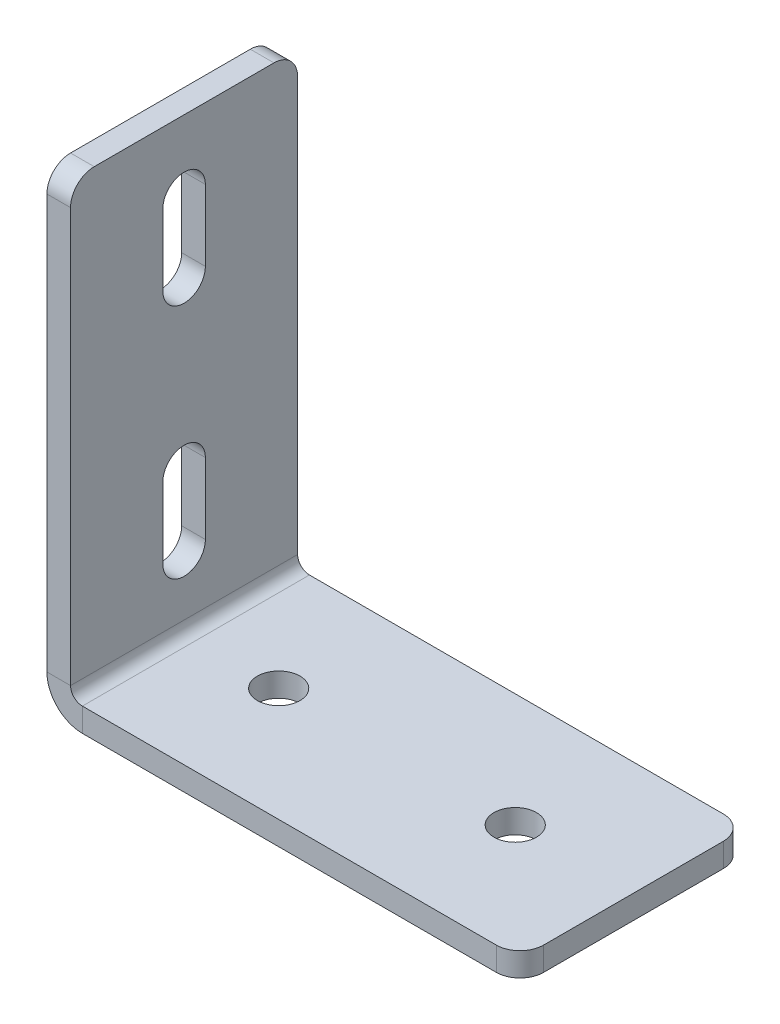
ISO-10303-21;
HEADER;
FILE_DESCRIPTION(('STEP AP214'),'2;1');
FILE_NAME('part.step','',(''),(''),'','','');
FILE_SCHEMA(('AUTOMOTIVE_DESIGN { 1 0 10303 214 1 1 1 1 }'));
ENDSEC;
DATA;
#1=APPLICATION_CONTEXT('core data for automotive mechanical design processes');
#2=APPLICATION_PROTOCOL_DEFINITION('international standard','automotive_design',2000,#1);
#3=PRODUCT_CONTEXT('',#1,'mechanical');
#4=PRODUCT('Part','Part','',(#3));
#5=PRODUCT_RELATED_PRODUCT_CATEGORY('part','',(#4));
#6=PRODUCT_DEFINITION_FORMATION('','',#4);
#7=PRODUCT_DEFINITION_CONTEXT('part definition',#1,'design');
#8=PRODUCT_DEFINITION('design','',#6,#7);
#9=PRODUCT_DEFINITION_SHAPE('','',#8);
#10=(LENGTH_UNIT() NAMED_UNIT(*) SI_UNIT(.MILLI.,.METRE.));
#11=(NAMED_UNIT(*) PLANE_ANGLE_UNIT() SI_UNIT($,.RADIAN.));
#12=(NAMED_UNIT(*) SI_UNIT($,.STERADIAN.) SOLID_ANGLE_UNIT());
#13=UNCERTAINTY_MEASURE_WITH_UNIT(LENGTH_MEASURE(1.E-05),#10,'distance_accuracy_value','');
#14=(GEOMETRIC_REPRESENTATION_CONTEXT(3) GLOBAL_UNCERTAINTY_ASSIGNED_CONTEXT((#13)) GLOBAL_UNIT_ASSIGNED_CONTEXT((#10,
#11,#12)) REPRESENTATION_CONTEXT('',''));
#15=CARTESIAN_POINT('',(0.,0.,0.));
#16=DIRECTION('',(0.,0.,1.));
#17=DIRECTION('',(1.,0.,0.));
#18=AXIS2_PLACEMENT_3D('',#15,#16,#17);
#19=CARTESIAN_POINT('',(0.,70.,0.));
#20=DIRECTION('',(-1.,0.,0.));
#21=DIRECTION('',(0.,0.,1.));
#22=AXIS2_PLACEMENT_3D('',#19,#20,#21);
#23=CYLINDRICAL_SURFACE('',#22,4.5);
#24=CARTESIAN_POINT('',(4.99999999999999,70.,0.));
#25=DIRECTION('',(1.,0.,0.));
#26=DIRECTION('',(0.,0.,-1.));
#27=AXIS2_PLACEMENT_3D('',#24,#25,#26);
#28=CIRCLE('',#27,4.5);
#29=CARTESIAN_POINT('',(5.,70.,4.5));
#30=VERTEX_POINT('',#29);
#31=CARTESIAN_POINT('',(5.,70.,-4.50000000000001));
#32=VERTEX_POINT('',#31);
#33=EDGE_CURVE('E352',#30,#32,#28,.T.);
#34=ORIENTED_EDGE('',*,*,#33,.T.);
#35=DIRECTION('',(1.,0.,0.));
#36=VECTOR('',#35,1.);
#37=CARTESIAN_POINT('',(0.,70.,-4.50000000000001));
#38=LINE('',#37,#36);
#39=CARTESIAN_POINT('',(0.,70.,-4.50000000000001));
#40=VERTEX_POINT('',#39);
#41=EDGE_CURVE('E256',#40,#32,#38,.T.);
#42=ORIENTED_EDGE('',*,*,#41,.F.);
#43=CARTESIAN_POINT('',(0.,70.,0.));
#44=DIRECTION('',(1.,0.,0.));
#45=DIRECTION('',(0.,0.,-1.));
#46=AXIS2_PLACEMENT_3D('',#43,#44,#45);
#47=CIRCLE('',#46,4.5);
#48=CARTESIAN_POINT('',(0.,70.,4.5));
#49=VERTEX_POINT('',#48);
#50=EDGE_CURVE('E265',#49,#40,#47,.T.);
#51=ORIENTED_EDGE('',*,*,#50,.F.);
#52=DIRECTION('',(1.,0.,0.));
#53=VECTOR('',#52,1.);
#54=CARTESIAN_POINT('',(0.,70.,4.5));
#55=LINE('',#54,#53);
#56=EDGE_CURVE('E259',#49,#30,#55,.T.);
#57=ORIENTED_EDGE('',*,*,#56,.T.);
#58=EDGE_LOOP('',(#34,#42,#51,#57));
#59=FACE_BOUND('',#58,.T.);
#60=ADVANCED_FACE('F48',(#59),#23,.F.);
#61=CARTESIAN_POINT('',(0.,20.,0.));
#62=DIRECTION('',(-1.,0.,0.));
#63=DIRECTION('',(0.,0.,1.));
#64=AXIS2_PLACEMENT_3D('',#61,#62,#63);
#65=CYLINDRICAL_SURFACE('',#64,4.5);
#66=CARTESIAN_POINT('',(5.,20.,0.));
#67=DIRECTION('',(1.,0.,0.));
#68=DIRECTION('',(0.,0.,-1.));
#69=AXIS2_PLACEMENT_3D('',#66,#67,#68);
#70=CIRCLE('',#69,4.5);
#71=CARTESIAN_POINT('',(5.,20.,4.5));
#72=VERTEX_POINT('',#71);
#73=CARTESIAN_POINT('',(5.,20.,-4.50000000000001));
#74=VERTEX_POINT('',#73);
#75=EDGE_CURVE('E362',#72,#74,#70,.T.);
#76=ORIENTED_EDGE('',*,*,#75,.T.);
#77=DIRECTION('',(1.,0.,0.));
#78=VECTOR('',#77,1.);
#79=CARTESIAN_POINT('',(0.,20.,-4.50000000000001));
#80=LINE('',#79,#78);
#81=CARTESIAN_POINT('',(0.,20.,-4.50000000000001));
#82=VERTEX_POINT('',#81);
#83=EDGE_CURVE('E227',#82,#74,#80,.T.);
#84=ORIENTED_EDGE('',*,*,#83,.F.);
#85=CARTESIAN_POINT('',(0.,20.,0.));
#86=DIRECTION('',(1.,0.,0.));
#87=DIRECTION('',(0.,0.,-1.));
#88=AXIS2_PLACEMENT_3D('',#85,#86,#87);
#89=CIRCLE('',#88,4.5);
#90=CARTESIAN_POINT('',(0.,20.,4.5));
#91=VERTEX_POINT('',#90);
#92=EDGE_CURVE('E269',#91,#82,#89,.T.);
#93=ORIENTED_EDGE('',*,*,#92,.F.);
#94=DIRECTION('',(1.,0.,0.));
#95=VECTOR('',#94,1.);
#96=CARTESIAN_POINT('',(0.,20.,4.5));
#97=LINE('',#96,#95);
#98=EDGE_CURVE('E193',#91,#72,#97,.T.);
#99=ORIENTED_EDGE('',*,*,#98,.T.);
#100=EDGE_LOOP('',(#76,#84,#93,#99));
#101=FACE_BOUND('',#100,.T.);
#102=ADVANCED_FACE('F507',(#101),#65,.F.);
#103=CARTESIAN_POINT('',(0.,0.,24.));
#104=DIRECTION('',(0.,0.,-1.));
#105=DIRECTION('',(0.,-1.,0.));
#106=AXIS2_PLACEMENT_3D('',#103,#104,#105);
#107=PLANE('',#106);
#108=DIRECTION('',(0.,1.,0.));
#109=VECTOR('',#108,1.);
#110=CARTESIAN_POINT('',(5.,0.,24.));
#111=LINE('',#110,#109);
#112=CARTESIAN_POINT('',(5.,95.,24.));
#113=VERTEX_POINT('',#112);
#114=CARTESIAN_POINT('',(5.,7.5,24.));
#115=VERTEX_POINT('',#114);
#116=EDGE_CURVE('E359',#113,#115,#111,.F.);
#117=ORIENTED_EDGE('',*,*,#116,.F.);
#118=DIRECTION('',(1.,0.,0.));
#119=VECTOR('',#118,1.);
#120=CARTESIAN_POINT('',(0.,95.,24.));
#121=LINE('',#120,#119);
#122=CARTESIAN_POINT('',(0.,95.,24.));
#123=VERTEX_POINT('',#122);
#124=EDGE_CURVE('E11',#113,#123,#121,.F.);
#125=ORIENTED_EDGE('',*,*,#124,.T.);
#126=DIRECTION('',(0.,-1.,0.));
#127=VECTOR('',#126,1.);
#128=CARTESIAN_POINT('',(0.,0.,24.));
#129=LINE('',#128,#127);
#130=CARTESIAN_POINT('',(0.,7.5,24.));
#131=VERTEX_POINT('',#130);
#132=EDGE_CURVE('E273',#123,#131,#129,.T.);
#133=ORIENTED_EDGE('',*,*,#132,.T.);
#134=DIRECTION('',(-1.,0.,0.));
#135=VECTOR('',#134,1.);
#136=CARTESIAN_POINT('',(0.,7.5,24.));
#137=LINE('',#136,#135);
#138=EDGE_CURVE('E379',#115,#131,#137,.T.);
#139=ORIENTED_EDGE('',*,*,#138,.F.);
#140=EDGE_LOOP('',(#117,#125,#133,#139));
#141=FACE_BOUND('',#140,.T.);
#142=ADVANCED_FACE('F464',(#141),#107,.F.);
#143=CARTESIAN_POINT('',(0.,100.,-24.));
#144=DIRECTION('',(0.,-1.,0.));
#145=DIRECTION('',(0.,0.,1.));
#146=AXIS2_PLACEMENT_3D('',#143,#144,#145);
#147=PLANE('',#146);
#148=DIRECTION('',(0.,0.,1.));
#149=VECTOR('',#148,1.);
#150=CARTESIAN_POINT('',(5.,100.,-24.));
#151=LINE('',#150,#149);
#152=CARTESIAN_POINT('',(5.,100.,-19.));
#153=VERTEX_POINT('',#152);
#154=CARTESIAN_POINT('',(5.,100.,19.));
#155=VERTEX_POINT('',#154);
#156=EDGE_CURVE('E355',#153,#155,#151,.T.);
#157=ORIENTED_EDGE('',*,*,#156,.F.);
#158=DIRECTION('',(-1.,0.,0.));
#159=VECTOR('',#158,1.);
#160=CARTESIAN_POINT('',(0.,100.,-19.));
#161=LINE('',#160,#159);
#162=CARTESIAN_POINT('',(0.,100.,-19.));
#163=VERTEX_POINT('',#162);
#164=EDGE_CURVE('E414',#153,#163,#161,.T.);
#165=ORIENTED_EDGE('',*,*,#164,.T.);
#166=DIRECTION('',(0.,0.,1.));
#167=VECTOR('',#166,1.);
#168=CARTESIAN_POINT('',(0.,100.,-24.));
#169=LINE('',#168,#167);
#170=CARTESIAN_POINT('',(0.,100.,19.));
#171=VERTEX_POINT('',#170);
#172=EDGE_CURVE('E276',#163,#171,#169,.T.);
#173=ORIENTED_EDGE('',*,*,#172,.T.);
#174=DIRECTION('',(1.,0.,0.));
#175=VECTOR('',#174,1.);
#176=CARTESIAN_POINT('',(0.,100.,19.));
#177=LINE('',#176,#175);
#178=EDGE_CURVE('E411',#171,#155,#177,.T.);
#179=ORIENTED_EDGE('',*,*,#178,.T.);
#180=EDGE_LOOP('',(#157,#165,#173,#179));
#181=FACE_BOUND('',#180,.T.);
#182=ADVANCED_FACE('F442',(#181),#147,.F.);
#183=CARTESIAN_POINT('',(0.,0.,-24.));
#184=DIRECTION('',(0.,0.,-1.));
#185=DIRECTION('',(0.,-1.,0.));
#186=AXIS2_PLACEMENT_3D('',#183,#184,#185);
#187=PLANE('',#186);
#188=DIRECTION('',(0.,-1.,0.));
#189=VECTOR('',#188,1.);
#190=CARTESIAN_POINT('',(0.,0.,-24.));
#191=LINE('',#190,#189);
#192=CARTESIAN_POINT('',(0.,95.,-24.));
#193=VERTEX_POINT('',#192);
#194=CARTESIAN_POINT('',(0.,7.5,-24.));
#195=VERTEX_POINT('',#194);
#196=EDGE_CURVE('E280',#193,#195,#191,.T.);
#197=ORIENTED_EDGE('',*,*,#196,.F.);
#198=DIRECTION('',(1.,0.,0.));
#199=VECTOR('',#198,1.);
#200=CARTESIAN_POINT('',(0.,95.,-24.));
#201=LINE('',#200,#199);
#202=CARTESIAN_POINT('',(5.,95.,-24.));
#203=VERTEX_POINT('',#202);
#204=EDGE_CURVE('E424',#193,#203,#201,.T.);
#205=ORIENTED_EDGE('',*,*,#204,.T.);
#206=DIRECTION('',(0.,1.,0.));
#207=VECTOR('',#206,1.);
#208=CARTESIAN_POINT('',(5.,0.,-24.));
#209=LINE('',#208,#207);
#210=CARTESIAN_POINT('',(5.,7.5,-24.));
#211=VERTEX_POINT('',#210);
#212=EDGE_CURVE('E333',#203,#211,#209,.F.);
#213=ORIENTED_EDGE('',*,*,#212,.T.);
#214=DIRECTION('',(-1.,0.,0.));
#215=VECTOR('',#214,1.);
#216=CARTESIAN_POINT('',(0.,7.5,-24.));
#217=LINE('',#216,#215);
#218=EDGE_CURVE('E375',#211,#195,#217,.T.);
#219=ORIENTED_EDGE('',*,*,#218,.T.);
#220=EDGE_LOOP('',(#197,#205,#213,#219));
#221=FACE_BOUND('',#220,.T.);
#222=ADVANCED_FACE('F449',(#221),#187,.T.);
#223=CARTESIAN_POINT('',(7.5,7.5,-24.));
#224=DIRECTION('',(0.,0.,1.));
#225=DIRECTION('',(1.,0.,0.));
#226=AXIS2_PLACEMENT_3D('',#223,#224,#225);
#227=PLANE('',#226);
#228=ORIENTED_EDGE('',*,*,#218,.F.);
#229=CARTESIAN_POINT('',(7.5,7.5,-24.));
#230=DIRECTION('',(0.,0.,1.));
#231=DIRECTION('',(1.,0.,0.));
#232=AXIS2_PLACEMENT_3D('',#229,#230,#231);
#233=CIRCLE('',#232,2.5);
#234=CARTESIAN_POINT('',(7.5,5.,-24.));
#235=VERTEX_POINT('',#234);
#236=EDGE_CURVE('E348',#211,#235,#233,.T.);
#237=ORIENTED_EDGE('',*,*,#236,.T.);
#238=DIRECTION('',(0.,-1.,0.));
#239=VECTOR('',#238,1.);
#240=CARTESIAN_POINT('',(7.50000000000001,0.,-24.));
#241=LINE('',#240,#239);
#242=CARTESIAN_POINT('',(7.50000000000001,0.,-24.));
#243=VERTEX_POINT('',#242);
#244=EDGE_CURVE('E372',#235,#243,#241,.T.);
#245=ORIENTED_EDGE('',*,*,#244,.T.);
#246=CARTESIAN_POINT('',(7.5,7.5,-24.));
#247=DIRECTION('',(0.,0.,-1.));
#248=DIRECTION('',(-1.,0.,0.));
#249=AXIS2_PLACEMENT_3D('',#246,#247,#248);
#250=CIRCLE('',#249,7.5);
#251=EDGE_CURVE('E270',#195,#243,#250,.F.);
#252=ORIENTED_EDGE('',*,*,#251,.F.);
#253=EDGE_LOOP('',(#228,#237,#245,#252));
#254=FACE_BOUND('',#253,.T.);
#255=ADVANCED_FACE('F454',(#254),#227,.F.);
#256=CARTESIAN_POINT('',(100.,0.,-24.));
#257=DIRECTION('',(0.,0.,-1.));
#258=DIRECTION('',(1.,0.,0.));
#259=AXIS2_PLACEMENT_3D('',#256,#257,#258);
#260=PLANE('',#259);
#261=DIRECTION('',(1.,0.,0.));
#262=VECTOR('',#261,1.);
#263=CARTESIAN_POINT('',(100.,5.,-24.));
#264=LINE('',#263,#262);
#265=CARTESIAN_POINT('',(95.,5.,-24.));
#266=VERTEX_POINT('',#265);
#267=EDGE_CURVE('E327',#235,#266,#264,.T.);
#268=ORIENTED_EDGE('',*,*,#267,.T.);
#269=DIRECTION('',(0.,-1.,0.));
#270=VECTOR('',#269,1.);
#271=CARTESIAN_POINT('',(95.,0.,-24.));
#272=LINE('',#271,#270);
#273=CARTESIAN_POINT('',(95.,0.,-24.));
#274=VERTEX_POINT('',#273);
#275=EDGE_CURVE('E383',#266,#274,#272,.T.);
#276=ORIENTED_EDGE('',*,*,#275,.T.);
#277=DIRECTION('',(1.,0.,0.));
#278=VECTOR('',#277,1.);
#279=CARTESIAN_POINT('',(100.,0.,-24.));
#280=LINE('',#279,#278);
#281=EDGE_CURVE('E299',#243,#274,#280,.T.);
#282=ORIENTED_EDGE('',*,*,#281,.F.);
#283=ORIENTED_EDGE('',*,*,#244,.F.);
#284=EDGE_LOOP('',(#268,#276,#282,#283));
#285=FACE_BOUND('',#284,.T.);
#286=ADVANCED_FACE('F497',(#285),#260,.T.);
#287=CARTESIAN_POINT('',(100.,0.,-24.));
#288=DIRECTION('',(1.,0.,0.));
#289=DIRECTION('',(0.,0.,1.));
#290=AXIS2_PLACEMENT_3D('',#287,#288,#289);
#291=PLANE('',#290);
#292=DIRECTION('',(0.,0.,1.));
#293=VECTOR('',#292,1.);
#294=CARTESIAN_POINT('',(100.,0.,-24.));
#295=LINE('',#294,#293);
#296=CARTESIAN_POINT('',(100.,0.,-19.));
#297=VERTEX_POINT('',#296);
#298=CARTESIAN_POINT('',(100.,0.,19.));
#299=VERTEX_POINT('',#298);
#300=EDGE_CURVE('E291',#297,#299,#295,.T.);
#301=ORIENTED_EDGE('',*,*,#300,.F.);
#302=DIRECTION('',(0.,-1.,0.));
#303=VECTOR('',#302,1.);
#304=CARTESIAN_POINT('',(100.,0.,-19.));
#305=LINE('',#304,#303);
#306=CARTESIAN_POINT('',(100.,5.,-19.));
#307=VERTEX_POINT('',#306);
#308=EDGE_CURVE('E399',#297,#307,#305,.F.);
#309=ORIENTED_EDGE('',*,*,#308,.T.);
#310=DIRECTION('',(0.,0.,1.));
#311=VECTOR('',#310,1.);
#312=CARTESIAN_POINT('',(100.,5.,-24.));
#313=LINE('',#312,#311);
#314=CARTESIAN_POINT('',(100.,5.,19.));
#315=VERTEX_POINT('',#314);
#316=EDGE_CURVE('E337',#307,#315,#313,.T.);
#317=ORIENTED_EDGE('',*,*,#316,.T.);
#318=DIRECTION('',(0.,1.,0.));
#319=VECTOR('',#318,1.);
#320=CARTESIAN_POINT('',(100.,0.,19.));
#321=LINE('',#320,#319);
#322=EDGE_CURVE('E395',#315,#299,#321,.F.);
#323=ORIENTED_EDGE('',*,*,#322,.T.);
#324=EDGE_LOOP('',(#301,#309,#317,#323));
#325=FACE_BOUND('',#324,.T.);
#326=ADVANCED_FACE('F488',(#325),#291,.T.);
#327=CARTESIAN_POINT('',(100.,0.,24.));
#328=DIRECTION('',(0.,0.,-1.));
#329=DIRECTION('',(1.,0.,0.));
#330=AXIS2_PLACEMENT_3D('',#327,#328,#329);
#331=PLANE('',#330);
#332=DIRECTION('',(1.,0.,0.));
#333=VECTOR('',#332,1.);
#334=CARTESIAN_POINT('',(100.,0.,24.));
#335=LINE('',#334,#333);
#336=CARTESIAN_POINT('',(7.50000000000001,0.,24.));
#337=VERTEX_POINT('',#336);
#338=CARTESIAN_POINT('',(95.,0.,24.));
#339=VERTEX_POINT('',#338);
#340=EDGE_CURVE('E295',#337,#339,#335,.T.);
#341=ORIENTED_EDGE('',*,*,#340,.T.);
#342=DIRECTION('',(0.,-1.,0.));
#343=VECTOR('',#342,1.);
#344=CARTESIAN_POINT('',(95.,0.,24.));
#345=LINE('',#344,#343);
#346=CARTESIAN_POINT('',(95.,5.,24.));
#347=VERTEX_POINT('',#346);
#348=EDGE_CURVE('E408',#339,#347,#345,.F.);
#349=ORIENTED_EDGE('',*,*,#348,.T.);
#350=DIRECTION('',(1.,0.,0.));
#351=VECTOR('',#350,1.);
#352=CARTESIAN_POINT('',(100.,5.,24.));
#353=LINE('',#352,#351);
#354=CARTESIAN_POINT('',(7.50000000000001,5.,24.));
#355=VERTEX_POINT('',#354);
#356=EDGE_CURVE('E338',#355,#347,#353,.T.);
#357=ORIENTED_EDGE('',*,*,#356,.F.);
#358=DIRECTION('',(0.,-1.,0.));
#359=VECTOR('',#358,1.);
#360=CARTESIAN_POINT('',(7.50000000000001,0.,24.));
#361=LINE('',#360,#359);
#362=EDGE_CURVE('E311',#355,#337,#361,.T.);
#363=ORIENTED_EDGE('',*,*,#362,.T.);
#364=EDGE_LOOP('',(#341,#349,#357,#363));
#365=FACE_BOUND('',#364,.T.);
#366=ADVANCED_FACE('F475',(#365),#331,.F.);
#367=CARTESIAN_POINT('',(75.,0.,0.));
#368=DIRECTION('',(0.,-1.,0.));
#369=DIRECTION('',(1.,0.,0.));
#370=AXIS2_PLACEMENT_3D('',#367,#368,#369);
#371=CYLINDRICAL_SURFACE('',#370,4.49999999999999);
#372=CARTESIAN_POINT('',(75.,0.,0.));
#373=DIRECTION('',(0.,-1.,0.));
#374=DIRECTION('',(0.,0.,-1.));
#375=AXIS2_PLACEMENT_3D('',#372,#373,#374);
#376=CIRCLE('',#375,4.49999999999999);
#377=CARTESIAN_POINT('',(75.,0.,-4.49999999999998));
#378=VERTEX_POINT('',#377);
#379=EDGE_CURVE('E283',#378,#378,#376,.T.);
#380=ORIENTED_EDGE('',*,*,#379,.T.);
#381=EDGE_LOOP('',(#380));
#382=FACE_BOUND('',#381,.T.);
#383=CARTESIAN_POINT('',(75.,5.,0.));
#384=DIRECTION('',(0.,-1.,0.));
#385=DIRECTION('',(0.,0.,-1.));
#386=AXIS2_PLACEMENT_3D('',#383,#384,#385);
#387=CIRCLE('',#386,4.49999999999999);
#388=CARTESIAN_POINT('',(75.,5.,-4.49999999999998));
#389=VERTEX_POINT('',#388);
#390=EDGE_CURVE('E328',#389,#389,#387,.T.);
#391=ORIENTED_EDGE('',*,*,#390,.F.);
#392=EDGE_LOOP('',(#391));
#393=FACE_BOUND('',#392,.T.);
#394=ADVANCED_FACE('F555',(#382,#393),#371,.F.);
#395=CARTESIAN_POINT('',(25.,0.,0.));
#396=DIRECTION('',(0.,-1.,0.));
#397=DIRECTION('',(1.,0.,0.));
#398=AXIS2_PLACEMENT_3D('',#395,#396,#397);
#399=CYLINDRICAL_SURFACE('',#398,4.49999999999999);
#400=CARTESIAN_POINT('',(25.,0.,0.));
#401=DIRECTION('',(0.,-1.,0.));
#402=DIRECTION('',(0.,0.,-1.));
#403=AXIS2_PLACEMENT_3D('',#400,#401,#402);
#404=CIRCLE('',#403,4.49999999999999);
#405=CARTESIAN_POINT('',(25.,0.,-4.49999999999999));
#406=VERTEX_POINT('',#405);
#407=EDGE_CURVE('E287',#406,#406,#404,.T.);
#408=ORIENTED_EDGE('',*,*,#407,.T.);
#409=EDGE_LOOP('',(#408));
#410=FACE_BOUND('',#409,.T.);
#411=CARTESIAN_POINT('',(25.,5.,0.));
#412=DIRECTION('',(0.,-1.,0.));
#413=DIRECTION('',(0.,0.,-1.));
#414=AXIS2_PLACEMENT_3D('',#411,#412,#413);
#415=CIRCLE('',#414,4.49999999999999);
#416=CARTESIAN_POINT('',(25.,5.,-4.49999999999999));
#417=VERTEX_POINT('',#416);
#418=EDGE_CURVE('E332',#417,#417,#415,.T.);
#419=ORIENTED_EDGE('',*,*,#418,.F.);
#420=EDGE_LOOP('',(#419));
#421=FACE_BOUND('',#420,.T.);
#422=ADVANCED_FACE('F558',(#410,#421),#399,.F.);
#423=CARTESIAN_POINT('',(7.5,7.5,24.));
#424=DIRECTION('',(0.,0.,-1.));
#425=DIRECTION('',(-1.,0.,0.));
#426=AXIS2_PLACEMENT_3D('',#423,#424,#425);
#427=PLANE('',#426);
#428=CARTESIAN_POINT('',(7.5,7.5,24.));
#429=DIRECTION('',(0.,0.,1.));
#430=DIRECTION('',(1.,0.,0.));
#431=AXIS2_PLACEMENT_3D('',#428,#429,#430);
#432=CIRCLE('',#431,2.5);
#433=EDGE_CURVE('E226',#355,#115,#432,.F.);
#434=ORIENTED_EDGE('',*,*,#433,.T.);
#435=ORIENTED_EDGE('',*,*,#138,.T.);
#436=CARTESIAN_POINT('',(7.5,7.5,24.));
#437=DIRECTION('',(0.,0.,1.));
#438=DIRECTION('',(1.,0.,0.));
#439=AXIS2_PLACEMENT_3D('',#436,#437,#438);
#440=CIRCLE('',#439,7.5);
#441=EDGE_CURVE('E312',#337,#131,#440,.F.);
#442=ORIENTED_EDGE('',*,*,#441,.F.);
#443=ORIENTED_EDGE('',*,*,#362,.F.);
#444=EDGE_LOOP('',(#434,#435,#442,#443));
#445=FACE_BOUND('',#444,.T.);
#446=ADVANCED_FACE('F467',(#445),#427,.F.);
#447=CARTESIAN_POINT('',(100.,0.,-24.));
#448=DIRECTION('',(0.,-1.,0.));
#449=DIRECTION('',(1.,0.,0.));
#450=AXIS2_PLACEMENT_3D('',#447,#448,#449);
#451=PLANE('',#450);
#452=ORIENTED_EDGE('',*,*,#379,.F.);
#453=EDGE_LOOP('',(#452));
#454=FACE_BOUND('',#453,.T.);
#455=ORIENTED_EDGE('',*,*,#407,.F.);
#456=EDGE_LOOP('',(#455));
#457=FACE_BOUND('',#456,.T.);
#458=ORIENTED_EDGE('',*,*,#281,.T.);
#459=CARTESIAN_POINT('',(95.,0.,-19.));
#460=DIRECTION('',(0.,-1.,0.));
#461=DIRECTION('',(1.,0.,0.));
#462=AXIS2_PLACEMENT_3D('',#459,#460,#461);
#463=CIRCLE('',#462,5.);
#464=EDGE_CURVE('E392',#274,#297,#463,.T.);
#465=ORIENTED_EDGE('',*,*,#464,.T.);
#466=ORIENTED_EDGE('',*,*,#300,.T.);
#467=CARTESIAN_POINT('',(95.,0.,19.));
#468=DIRECTION('',(0.,-1.,0.));
#469=DIRECTION('',(1.,0.,0.));
#470=AXIS2_PLACEMENT_3D('',#467,#468,#469);
#471=CIRCLE('',#470,5.);
#472=EDGE_CURVE('E389',#299,#339,#471,.T.);
#473=ORIENTED_EDGE('',*,*,#472,.T.);
#474=ORIENTED_EDGE('',*,*,#340,.F.);
#475=DIRECTION('',(0.,0.,1.));
#476=VECTOR('',#475,1.);
#477=CARTESIAN_POINT('',(7.50000000000001,0.,-24.));
#478=LINE('',#477,#476);
#479=EDGE_CURVE('E307',#337,#243,#478,.F.);
#480=ORIENTED_EDGE('',*,*,#479,.T.);
#481=EDGE_LOOP('',(#458,#465,#466,#473,#474,#480));
#482=FACE_BOUND('',#481,.T.);
#483=ADVANCED_FACE('F491',(#454,#457,#482),#451,.T.);
#484=CARTESIAN_POINT('',(0.,0.,-24.));
#485=DIRECTION('',(-1.,0.,0.));
#486=DIRECTION('',(0.,0.,1.));
#487=AXIS2_PLACEMENT_3D('',#484,#485,#486);
#488=PLANE('',#487);
#489=DIRECTION('',(0.,1.,0.));
#490=VECTOR('',#489,1.);
#491=CARTESIAN_POINT('',(0.,35.,-4.5));
#492=LINE('',#491,#490);
#493=CARTESIAN_POINT('',(0.,35.,-4.5));
#494=VERTEX_POINT('',#493);
#495=EDGE_CURVE('E194',#82,#494,#492,.T.);
#496=ORIENTED_EDGE('',*,*,#495,.T.);
#497=CARTESIAN_POINT('',(0.,35.,0.));
#498=DIRECTION('',(1.,0.,0.));
#499=DIRECTION('',(0.,0.,-1.));
#500=AXIS2_PLACEMENT_3D('',#497,#498,#499);
#501=CIRCLE('',#500,4.5);
#502=CARTESIAN_POINT('',(0.,35.,4.5));
#503=VERTEX_POINT('',#502);
#504=EDGE_CURVE('E188',#494,#503,#501,.T.);
#505=ORIENTED_EDGE('',*,*,#504,.T.);
#506=DIRECTION('',(0.,-1.,0.));
#507=VECTOR('',#506,1.);
#508=CARTESIAN_POINT('',(0.,35.,4.5));
#509=LINE('',#508,#507);
#510=EDGE_CURVE('E197',#503,#91,#509,.T.);
#511=ORIENTED_EDGE('',*,*,#510,.T.);
#512=ORIENTED_EDGE('',*,*,#92,.T.);
#513=EDGE_LOOP('',(#496,#505,#511,#512));
#514=FACE_BOUND('',#513,.T.);
#515=DIRECTION('',(0.,1.,0.));
#516=VECTOR('',#515,1.);
#517=CARTESIAN_POINT('',(0.,85.,-4.5));
#518=LINE('',#517,#516);
#519=CARTESIAN_POINT('',(0.,85.,-4.5));
#520=VERTEX_POINT('',#519);
#521=EDGE_CURVE('E241',#40,#520,#518,.T.);
#522=ORIENTED_EDGE('',*,*,#521,.T.);
#523=CARTESIAN_POINT('',(0.,85.,0.));
#524=DIRECTION('',(1.,0.,0.));
#525=DIRECTION('',(0.,0.,-1.));
#526=AXIS2_PLACEMENT_3D('',#523,#524,#525);
#527=CIRCLE('',#526,4.5);
#528=CARTESIAN_POINT('',(0.,85.,4.5));
#529=VERTEX_POINT('',#528);
#530=EDGE_CURVE('E232',#520,#529,#527,.T.);
#531=ORIENTED_EDGE('',*,*,#530,.T.);
#532=DIRECTION('',(0.,-1.,0.));
#533=VECTOR('',#532,1.);
#534=CARTESIAN_POINT('',(0.,85.,4.5));
#535=LINE('',#534,#533);
#536=EDGE_CURVE('E236',#529,#49,#535,.T.);
#537=ORIENTED_EDGE('',*,*,#536,.T.);
#538=ORIENTED_EDGE('',*,*,#50,.T.);
#539=EDGE_LOOP('',(#522,#531,#537,#538));
#540=FACE_BOUND('',#539,.T.);
#541=ORIENTED_EDGE('',*,*,#172,.F.);
#542=CARTESIAN_POINT('',(0.,95.,-19.));
#543=DIRECTION('',(-1.,0.,0.));
#544=DIRECTION('',(0.,0.,1.));
#545=AXIS2_PLACEMENT_3D('',#542,#543,#544);
#546=CIRCLE('',#545,5.);
#547=EDGE_CURVE('E421',#163,#193,#546,.T.);
#548=ORIENTED_EDGE('',*,*,#547,.T.);
#549=ORIENTED_EDGE('',*,*,#196,.T.);
#550=DIRECTION('',(0.,0.,1.));
#551=VECTOR('',#550,1.);
#552=CARTESIAN_POINT('',(0.,7.5,-24.));
#553=LINE('',#552,#551);
#554=EDGE_CURVE('E303',#195,#131,#553,.T.);
#555=ORIENTED_EDGE('',*,*,#554,.T.);
#556=ORIENTED_EDGE('',*,*,#132,.F.);
#557=CARTESIAN_POINT('',(0.,95.,19.));
#558=DIRECTION('',(-1.,0.,0.));
#559=DIRECTION('',(0.,0.,1.));
#560=AXIS2_PLACEMENT_3D('',#557,#558,#559);
#561=CIRCLE('',#560,5.);
#562=EDGE_CURVE('E418',#123,#171,#561,.T.);
#563=ORIENTED_EDGE('',*,*,#562,.T.);
#564=EDGE_LOOP('',(#541,#548,#549,#555,#556,#563));
#565=FACE_BOUND('',#564,.T.);
#566=ADVANCED_FACE('F205',(#514,#540,#565),#488,.T.);
#567=CARTESIAN_POINT('',(7.5,7.5,-24.));
#568=DIRECTION('',(0.,0.,1.));
#569=DIRECTION('',(1.,0.,0.));
#570=AXIS2_PLACEMENT_3D('',#567,#568,#569);
#571=CYLINDRICAL_SURFACE('',#570,7.5);
#572=ORIENTED_EDGE('',*,*,#251,.T.);
#573=ORIENTED_EDGE('',*,*,#479,.F.);
#574=ORIENTED_EDGE('',*,*,#441,.T.);
#575=ORIENTED_EDGE('',*,*,#554,.F.);
#576=EDGE_LOOP('',(#572,#573,#574,#575));
#577=FACE_BOUND('',#576,.T.);
#578=ADVANCED_FACE('F458',(#577),#571,.T.);
#579=CARTESIAN_POINT('',(100.,5.,-24.));
#580=DIRECTION('',(0.,-1.,0.));
#581=DIRECTION('',(1.,0.,0.));
#582=AXIS2_PLACEMENT_3D('',#579,#580,#581);
#583=PLANE('',#582);
#584=ORIENTED_EDGE('',*,*,#390,.T.);
#585=EDGE_LOOP('',(#584));
#586=FACE_BOUND('',#585,.T.);
#587=ORIENTED_EDGE('',*,*,#418,.T.);
#588=EDGE_LOOP('',(#587));
#589=FACE_BOUND('',#588,.T.);
#590=ORIENTED_EDGE('',*,*,#316,.F.);
#591=CARTESIAN_POINT('',(95.,5.,-19.));
#592=DIRECTION('',(0.,-1.,0.));
#593=DIRECTION('',(1.,0.,0.));
#594=AXIS2_PLACEMENT_3D('',#591,#592,#593);
#595=CIRCLE('',#594,5.);
#596=EDGE_CURVE('E405',#307,#266,#595,.F.);
#597=ORIENTED_EDGE('',*,*,#596,.T.);
#598=ORIENTED_EDGE('',*,*,#267,.F.);
#599=DIRECTION('',(0.,0.,1.));
#600=VECTOR('',#599,1.);
#601=CARTESIAN_POINT('',(7.50000000000001,5.,-24.));
#602=LINE('',#601,#600);
#603=EDGE_CURVE('E316',#355,#235,#602,.F.);
#604=ORIENTED_EDGE('',*,*,#603,.F.);
#605=ORIENTED_EDGE('',*,*,#356,.T.);
#606=CARTESIAN_POINT('',(95.,5.,19.));
#607=DIRECTION('',(0.,-1.,0.));
#608=DIRECTION('',(1.,0.,0.));
#609=AXIS2_PLACEMENT_3D('',#606,#607,#608);
#610=CIRCLE('',#609,5.);
#611=EDGE_CURVE('E402',#347,#315,#610,.F.);
#612=ORIENTED_EDGE('',*,*,#611,.T.);
#613=EDGE_LOOP('',(#590,#597,#598,#604,#605,#612));
#614=FACE_BOUND('',#613,.T.);
#615=ADVANCED_FACE('F481',(#586,#589,#614),#583,.F.);
#616=CARTESIAN_POINT('',(5.,0.,-24.));
#617=DIRECTION('',(-1.,0.,0.));
#618=DIRECTION('',(0.,0.,1.));
#619=AXIS2_PLACEMENT_3D('',#616,#617,#618);
#620=PLANE('',#619);
#621=CARTESIAN_POINT('',(5.,85.,0.));
#622=DIRECTION('',(1.,0.,0.));
#623=DIRECTION('',(0.,0.,-1.));
#624=AXIS2_PLACEMENT_3D('',#621,#622,#623);
#625=CIRCLE('',#624,4.5);
#626=CARTESIAN_POINT('',(5.,85.,-4.5));
#627=VERTEX_POINT('',#626);
#628=CARTESIAN_POINT('',(5.,85.,4.50000000000001));
#629=VERTEX_POINT('',#628);
#630=EDGE_CURVE('E72',#627,#629,#625,.T.);
#631=ORIENTED_EDGE('',*,*,#630,.F.);
#632=DIRECTION('',(0.,1.,0.));
#633=VECTOR('',#632,1.);
#634=CARTESIAN_POINT('',(5.,85.,-4.5));
#635=LINE('',#634,#633);
#636=EDGE_CURVE('E237',#32,#627,#635,.T.);
#637=ORIENTED_EDGE('',*,*,#636,.F.);
#638=ORIENTED_EDGE('',*,*,#33,.F.);
#639=DIRECTION('',(0.,-1.,0.));
#640=VECTOR('',#639,1.);
#641=CARTESIAN_POINT('',(5.,85.,4.5));
#642=LINE('',#641,#640);
#643=EDGE_CURVE('E248',#629,#30,#642,.T.);
#644=ORIENTED_EDGE('',*,*,#643,.F.);
#645=EDGE_LOOP('',(#631,#637,#638,#644));
#646=FACE_BOUND('',#645,.T.);
#647=CARTESIAN_POINT('',(5.,35.,0.));
#648=DIRECTION('',(1.,0.,0.));
#649=DIRECTION('',(0.,0.,-1.));
#650=AXIS2_PLACEMENT_3D('',#647,#648,#649);
#651=CIRCLE('',#650,4.5);
#652=CARTESIAN_POINT('',(5.,35.,-4.5));
#653=VERTEX_POINT('',#652);
#654=CARTESIAN_POINT('',(5.,35.,4.5));
#655=VERTEX_POINT('',#654);
#656=EDGE_CURVE('E64',#653,#655,#651,.T.);
#657=ORIENTED_EDGE('',*,*,#656,.F.);
#658=DIRECTION('',(0.,1.,0.));
#659=VECTOR('',#658,1.);
#660=CARTESIAN_POINT('',(5.,35.,-4.5));
#661=LINE('',#660,#659);
#662=EDGE_CURVE('E208',#74,#653,#661,.T.);
#663=ORIENTED_EDGE('',*,*,#662,.F.);
#664=ORIENTED_EDGE('',*,*,#75,.F.);
#665=DIRECTION('',(0.,-1.,0.));
#666=VECTOR('',#665,1.);
#667=CARTESIAN_POINT('',(5.,35.,4.5));
#668=LINE('',#667,#666);
#669=EDGE_CURVE('E213',#655,#72,#668,.T.);
#670=ORIENTED_EDGE('',*,*,#669,.F.);
#671=EDGE_LOOP('',(#657,#663,#664,#670));
#672=FACE_BOUND('',#671,.T.);
#673=ORIENTED_EDGE('',*,*,#212,.F.);
#674=CARTESIAN_POINT('',(5.,95.,-19.));
#675=DIRECTION('',(-1.,0.,0.));
#676=DIRECTION('',(0.,0.,1.));
#677=AXIS2_PLACEMENT_3D('',#674,#675,#676);
#678=CIRCLE('',#677,5.);
#679=EDGE_CURVE('E57',#203,#153,#678,.F.);
#680=ORIENTED_EDGE('',*,*,#679,.T.);
#681=ORIENTED_EDGE('',*,*,#156,.T.);
#682=CARTESIAN_POINT('',(5.,95.,19.));
#683=DIRECTION('',(-1.,0.,0.));
#684=DIRECTION('',(0.,0.,1.));
#685=AXIS2_PLACEMENT_3D('',#682,#683,#684);
#686=CIRCLE('',#685,5.);
#687=EDGE_CURVE('E427',#155,#113,#686,.F.);
#688=ORIENTED_EDGE('',*,*,#687,.T.);
#689=ORIENTED_EDGE('',*,*,#116,.T.);
#690=DIRECTION('',(0.,0.,1.));
#691=VECTOR('',#690,1.);
#692=CARTESIAN_POINT('',(5.,7.5,-24.));
#693=LINE('',#692,#691);
#694=EDGE_CURVE('E323',#211,#115,#693,.T.);
#695=ORIENTED_EDGE('',*,*,#694,.F.);
#696=EDGE_LOOP('',(#673,#680,#681,#688,#689,#695));
#697=FACE_BOUND('',#696,.T.);
#698=ADVANCED_FACE('F435',(#646,#672,#697),#620,.F.);
#699=CARTESIAN_POINT('',(7.5,7.5,-24.));
#700=DIRECTION('',(0.,0.,1.));
#701=DIRECTION('',(1.,0.,0.));
#702=AXIS2_PLACEMENT_3D('',#699,#700,#701);
#703=CYLINDRICAL_SURFACE('',#702,2.5);
#704=ORIENTED_EDGE('',*,*,#236,.F.);
#705=ORIENTED_EDGE('',*,*,#694,.T.);
#706=ORIENTED_EDGE('',*,*,#433,.F.);
#707=ORIENTED_EDGE('',*,*,#603,.T.);
#708=EDGE_LOOP('',(#704,#705,#706,#707));
#709=FACE_BOUND('',#708,.T.);
#710=ADVANCED_FACE('F473',(#709),#703,.F.);
#711=CARTESIAN_POINT('',(95.,0.,-19.));
#712=DIRECTION('',(0.,-1.,0.));
#713=DIRECTION('',(1.,0.,0.));
#714=AXIS2_PLACEMENT_3D('',#711,#712,#713);
#715=CYLINDRICAL_SURFACE('',#714,5.);
#716=ORIENTED_EDGE('',*,*,#596,.F.);
#717=ORIENTED_EDGE('',*,*,#308,.F.);
#718=ORIENTED_EDGE('',*,*,#464,.F.);
#719=ORIENTED_EDGE('',*,*,#275,.F.);
#720=EDGE_LOOP('',(#716,#717,#718,#719));
#721=FACE_BOUND('',#720,.T.);
#722=ADVANCED_FACE('F495',(#721),#715,.T.);
#723=CARTESIAN_POINT('',(95.,0.,19.));
#724=DIRECTION('',(0.,1.,0.));
#725=DIRECTION('',(-1.,0.,0.));
#726=AXIS2_PLACEMENT_3D('',#723,#724,#725);
#727=CYLINDRICAL_SURFACE('',#726,5.);
#728=ORIENTED_EDGE('',*,*,#611,.F.);
#729=ORIENTED_EDGE('',*,*,#348,.F.);
#730=ORIENTED_EDGE('',*,*,#472,.F.);
#731=ORIENTED_EDGE('',*,*,#322,.F.);
#732=EDGE_LOOP('',(#728,#729,#730,#731));
#733=FACE_BOUND('',#732,.T.);
#734=ADVANCED_FACE('F485',(#733),#727,.T.);
#735=CARTESIAN_POINT('',(0.,95.,-19.));
#736=DIRECTION('',(1.,0.,0.));
#737=DIRECTION('',(0.,0.,-1.));
#738=AXIS2_PLACEMENT_3D('',#735,#736,#737);
#739=CYLINDRICAL_SURFACE('',#738,5.);
#740=ORIENTED_EDGE('',*,*,#679,.F.);
#741=ORIENTED_EDGE('',*,*,#204,.F.);
#742=ORIENTED_EDGE('',*,*,#547,.F.);
#743=ORIENTED_EDGE('',*,*,#164,.F.);
#744=EDGE_LOOP('',(#740,#741,#742,#743));
#745=FACE_BOUND('',#744,.T.);
#746=ADVANCED_FACE('F445',(#745),#739,.T.);
#747=CARTESIAN_POINT('',(0.,95.,19.));
#748=DIRECTION('',(-1.,0.,0.));
#749=DIRECTION('',(0.,0.,1.));
#750=AXIS2_PLACEMENT_3D('',#747,#748,#749);
#751=CYLINDRICAL_SURFACE('',#750,5.);
#752=ORIENTED_EDGE('',*,*,#687,.F.);
#753=ORIENTED_EDGE('',*,*,#178,.F.);
#754=ORIENTED_EDGE('',*,*,#562,.F.);
#755=ORIENTED_EDGE('',*,*,#124,.F.);
#756=EDGE_LOOP('',(#752,#753,#754,#755));
#757=FACE_BOUND('',#756,.T.);
#758=ADVANCED_FACE('F50',(#757),#751,.T.);
#759=CARTESIAN_POINT('',(0.,85.,0.));
#760=DIRECTION('',(1.,0.,0.));
#761=DIRECTION('',(0.,0.,-1.));
#762=AXIS2_PLACEMENT_3D('',#759,#760,#761);
#763=CYLINDRICAL_SURFACE('',#762,4.5);
#764=ORIENTED_EDGE('',*,*,#630,.T.);
#765=DIRECTION('',(1.,0.,0.));
#766=VECTOR('',#765,1.);
#767=CARTESIAN_POINT('',(0.,85.,4.5));
#768=LINE('',#767,#766);
#769=EDGE_CURVE('E245',#529,#629,#768,.T.);
#770=ORIENTED_EDGE('',*,*,#769,.F.);
#771=ORIENTED_EDGE('',*,*,#530,.F.);
#772=DIRECTION('',(1.,0.,0.));
#773=VECTOR('',#772,1.);
#774=CARTESIAN_POINT('',(0.,85.,-4.5));
#775=LINE('',#774,#773);
#776=EDGE_CURVE('E220',#520,#627,#775,.T.);
#777=ORIENTED_EDGE('',*,*,#776,.T.);
#778=EDGE_LOOP('',(#764,#770,#771,#777));
#779=FACE_BOUND('',#778,.T.);
#780=ADVANCED_FACE('F525',(#779),#763,.F.);
#781=CARTESIAN_POINT('',(0.,85.,-4.5));
#782=DIRECTION('',(0.,0.,-1.));
#783=DIRECTION('',(0.,1.,0.));
#784=AXIS2_PLACEMENT_3D('',#781,#782,#783);
#785=PLANE('',#784);
#786=ORIENTED_EDGE('',*,*,#636,.T.);
#787=ORIENTED_EDGE('',*,*,#776,.F.);
#788=ORIENTED_EDGE('',*,*,#521,.F.);
#789=ORIENTED_EDGE('',*,*,#41,.T.);
#790=EDGE_LOOP('',(#786,#787,#788,#789));
#791=FACE_BOUND('',#790,.T.);
#792=ADVANCED_FACE('F530',(#791),#785,.F.);
#793=CARTESIAN_POINT('',(0.,85.,4.5));
#794=DIRECTION('',(0.,0.,1.));
#795=DIRECTION('',(0.,-1.,0.));
#796=AXIS2_PLACEMENT_3D('',#793,#794,#795);
#797=PLANE('',#796);
#798=ORIENTED_EDGE('',*,*,#643,.T.);
#799=ORIENTED_EDGE('',*,*,#56,.F.);
#800=ORIENTED_EDGE('',*,*,#536,.F.);
#801=ORIENTED_EDGE('',*,*,#769,.T.);
#802=EDGE_LOOP('',(#798,#799,#800,#801));
#803=FACE_BOUND('',#802,.T.);
#804=ADVANCED_FACE('F535',(#803),#797,.F.);
#805=CARTESIAN_POINT('',(0.,35.,0.));
#806=DIRECTION('',(1.,0.,0.));
#807=DIRECTION('',(0.,0.,-1.));
#808=AXIS2_PLACEMENT_3D('',#805,#806,#807);
#809=CYLINDRICAL_SURFACE('',#808,4.5);
#810=ORIENTED_EDGE('',*,*,#656,.T.);
#811=DIRECTION('',(1.,0.,0.));
#812=VECTOR('',#811,1.);
#813=CARTESIAN_POINT('',(0.,35.,4.5));
#814=LINE('',#813,#812);
#815=EDGE_CURVE('E184',#503,#655,#814,.T.);
#816=ORIENTED_EDGE('',*,*,#815,.F.);
#817=ORIENTED_EDGE('',*,*,#504,.F.);
#818=DIRECTION('',(1.,0.,0.));
#819=VECTOR('',#818,1.);
#820=CARTESIAN_POINT('',(0.,35.,-4.5));
#821=LINE('',#820,#819);
#822=EDGE_CURVE('E223',#494,#653,#821,.T.);
#823=ORIENTED_EDGE('',*,*,#822,.T.);
#824=EDGE_LOOP('',(#810,#816,#817,#823));
#825=FACE_BOUND('',#824,.T.);
#826=ADVANCED_FACE('F186',(#825),#809,.F.);
#827=CARTESIAN_POINT('',(0.,35.,-4.5));
#828=DIRECTION('',(0.,0.,-1.));
#829=DIRECTION('',(0.,1.,0.));
#830=AXIS2_PLACEMENT_3D('',#827,#828,#829);
#831=PLANE('',#830);
#832=ORIENTED_EDGE('',*,*,#662,.T.);
#833=ORIENTED_EDGE('',*,*,#822,.F.);
#834=ORIENTED_EDGE('',*,*,#495,.F.);
#835=ORIENTED_EDGE('',*,*,#83,.T.);
#836=EDGE_LOOP('',(#832,#833,#834,#835));
#837=FACE_BOUND('',#836,.T.);
#838=ADVANCED_FACE('F642',(#837),#831,.F.);
#839=CARTESIAN_POINT('',(0.,35.,4.5));
#840=DIRECTION('',(0.,0.,1.));
#841=DIRECTION('',(0.,-1.,0.));
#842=AXIS2_PLACEMENT_3D('',#839,#840,#841);
#843=PLANE('',#842);
#844=ORIENTED_EDGE('',*,*,#669,.T.);
#845=ORIENTED_EDGE('',*,*,#98,.F.);
#846=ORIENTED_EDGE('',*,*,#510,.F.);
#847=ORIENTED_EDGE('',*,*,#815,.T.);
#848=EDGE_LOOP('',(#844,#845,#846,#847));
#849=FACE_BOUND('',#848,.T.);
#850=ADVANCED_FACE('F198',(#849),#843,.F.);
#851=CLOSED_SHELL('',(#60,#102,#142,#182,#222,#255,#286,#326,#366,#394,#422,#446,#483,#566,#578,
#615,#698,#710,#722,#734,#746,#758,#780,#792,#804,#826,#838,#850));
#852=MANIFOLD_SOLID_BREP('B2',#851);
#853=ADVANCED_BREP_SHAPE_REPRESENTATION('',(#18,#852),#14);
#854=SHAPE_DEFINITION_REPRESENTATION(#9,#853);
ENDSEC;
END-ISO-10303-21;
